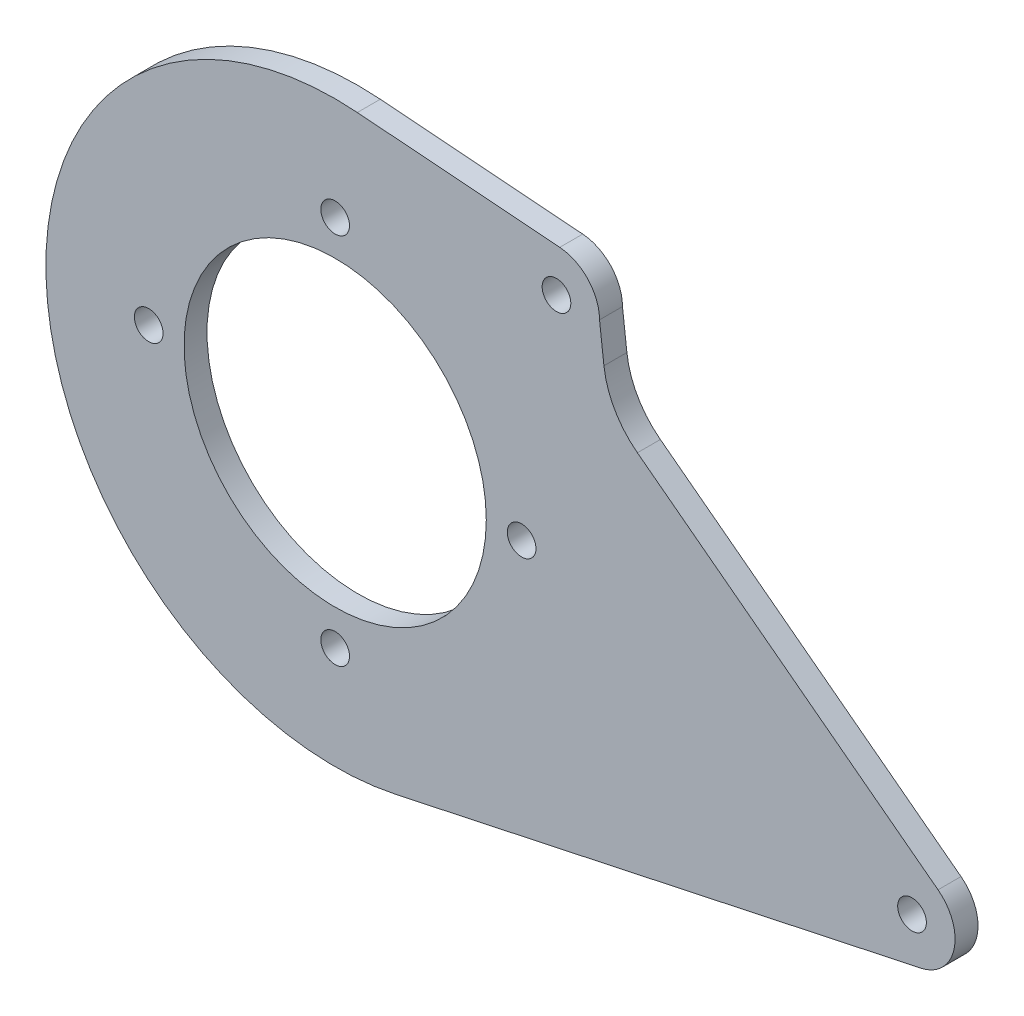
ISO-10303-21;
HEADER;
FILE_DESCRIPTION(('STEP AP214'),'2;1');
FILE_NAME('part.step','',(''),(''),'','','');
FILE_SCHEMA(('AUTOMOTIVE_DESIGN { 1 0 10303 214 1 1 1 1 }'));
ENDSEC;
DATA;
#1=APPLICATION_CONTEXT('core data for automotive mechanical design processes');
#2=APPLICATION_PROTOCOL_DEFINITION('international standard','automotive_design',2000,#1);
#3=PRODUCT_CONTEXT('',#1,'mechanical');
#4=PRODUCT('Part','Part','',(#3));
#5=PRODUCT_RELATED_PRODUCT_CATEGORY('part','',(#4));
#6=PRODUCT_DEFINITION_FORMATION('','',#4);
#7=PRODUCT_DEFINITION_CONTEXT('part definition',#1,'design');
#8=PRODUCT_DEFINITION('design','',#6,#7);
#9=PRODUCT_DEFINITION_SHAPE('','',#8);
#10=(LENGTH_UNIT() NAMED_UNIT(*) SI_UNIT(.MILLI.,.METRE.));
#11=(NAMED_UNIT(*) PLANE_ANGLE_UNIT() SI_UNIT($,.RADIAN.));
#12=(NAMED_UNIT(*) SI_UNIT($,.STERADIAN.) SOLID_ANGLE_UNIT());
#13=UNCERTAINTY_MEASURE_WITH_UNIT(LENGTH_MEASURE(1.E-05),#10,'distance_accuracy_value','');
#14=(GEOMETRIC_REPRESENTATION_CONTEXT(3) GLOBAL_UNCERTAINTY_ASSIGNED_CONTEXT((#13)) GLOBAL_UNIT_ASSIGNED_CONTEXT((#10,
#11,#12)) REPRESENTATION_CONTEXT('',''));
#15=CARTESIAN_POINT('',(0.,0.,0.));
#16=DIRECTION('',(0.,0.,1.));
#17=DIRECTION('',(1.,0.,0.));
#18=AXIS2_PLACEMENT_3D('',#15,#16,#17);
#19=CARTESIAN_POINT('',(0.,0.,10.16));
#20=DIRECTION('',(0.,0.,1.));
#21=DIRECTION('',(1.,0.,0.));
#22=AXIS2_PLACEMENT_3D('',#19,#20,#21);
#23=PLANE('',#22);
#24=CARTESIAN_POINT('',(82.5,0.,10.16));
#25=DIRECTION('',(0.,0.,1.));
#26=DIRECTION('',(1.,0.,0.));
#27=AXIS2_PLACEMENT_3D('',#24,#25,#26);
#28=CIRCLE('',#27,6.35);
#29=CARTESIAN_POINT('',(88.85,0.,10.16));
#30=VERTEX_POINT('',#29);
#31=EDGE_CURVE('E214',#30,#30,#28,.T.);
#32=ORIENTED_EDGE('',*,*,#31,.F.);
#33=EDGE_LOOP('',(#32));
#34=FACE_BOUND('',#33,.T.);
#35=CARTESIAN_POINT('',(-82.5,0.,10.16));
#36=DIRECTION('',(0.,0.,1.));
#37=DIRECTION('',(1.,0.,0.));
#38=AXIS2_PLACEMENT_3D('',#35,#36,#37);
#39=CIRCLE('',#38,6.35);
#40=CARTESIAN_POINT('',(-76.15,0.,10.16));
#41=VERTEX_POINT('',#40);
#42=EDGE_CURVE('E202',#41,#41,#39,.T.);
#43=ORIENTED_EDGE('',*,*,#42,.F.);
#44=EDGE_LOOP('',(#43));
#45=FACE_BOUND('',#44,.T.);
#46=CARTESIAN_POINT('',(0.,0.,10.16));
#47=DIRECTION('',(0.,0.,1.));
#48=DIRECTION('',(1.,0.,0.));
#49=AXIS2_PLACEMENT_3D('',#46,#47,#48);
#50=CIRCLE('',#49,66.87);
#51=CARTESIAN_POINT('',(66.87,0.,10.16));
#52=VERTEX_POINT('',#51);
#53=EDGE_CURVE('E190',#52,#52,#50,.T.);
#54=ORIENTED_EDGE('',*,*,#53,.F.);
#55=EDGE_LOOP('',(#54));
#56=FACE_BOUND('',#55,.T.);
#57=CARTESIAN_POINT('',(0.,0.,10.16));
#58=DIRECTION('',(0.,0.,1.));
#59=DIRECTION('',(1.,0.,0.));
#60=AXIS2_PLACEMENT_3D('',#57,#58,#59);
#61=CIRCLE('',#60,128.);
#62=CARTESIAN_POINT('',(9.80508100267259,127.62390209726,10.16));
#63=VERTEX_POINT('',#62);
#64=CARTESIAN_POINT('',(26.7127683770055,-125.181580137161,10.16));
#65=VERTEX_POINT('',#64);
#66=EDGE_CURVE('E153',#63,#65,#61,.T.);
#67=ORIENTED_EDGE('',*,*,#66,.T.);
#68=DIRECTION('',(0.977981094821572,0.208693502945346,0.));
#69=VECTOR('',#68,1.);
#70=CARTESIAN_POINT('',(26.7127683770055,-125.181580137161,10.16));
#71=LINE('',#70,#69);
#72=CARTESIAN_POINT('',(259.206689864171,-75.5691989310529,10.16));
#73=VERTEX_POINT('',#72);
#74=EDGE_CURVE('E101',#65,#73,#71,.T.);
#75=ORIENTED_EDGE('',*,*,#74,.T.);
#76=CARTESIAN_POINT('',(255.236487197195,-56.9375057502599,10.16));
#77=DIRECTION('',(0.,0.,1.));
#78=DIRECTION('',(1.,0.,0.));
#79=AXIS2_PLACEMENT_3D('',#76,#77,#78);
#80=CIRCLE('',#79,19.0500000000018);
#81=CARTESIAN_POINT('',(266.753249652273,-41.7629651458977,10.16));
#82=VERTEX_POINT('',#81);
#83=EDGE_CURVE('E168',#73,#82,#80,.T.);
#84=ORIENTED_EDGE('',*,*,#83,.T.);
#85=DIRECTION('',(-0.796563811252454,0.604554459584051,0.));
#86=VECTOR('',#85,1.);
#87=CARTESIAN_POINT('',(133.724592453404,59.1995275332562,10.16));
#88=LINE('',#87,#86);
#89=CARTESIAN_POINT('',(133.724592453404,59.1995275332562,10.16));
#90=VERTEX_POINT('',#89);
#91=EDGE_CURVE('E181',#82,#90,#88,.T.);
#92=ORIENTED_EDGE('',*,*,#91,.T.);
#93=CARTESIAN_POINT('',(156.758117363557,89.5486087419742,10.16));
#94=DIRECTION('',(0.,0.,-1.));
#95=DIRECTION('',(-1.,0.,0.));
#96=AXIS2_PLACEMENT_3D('',#93,#94,#95);
#97=CIRCLE('',#96,38.1);
#98=CARTESIAN_POINT('',(118.916102857405,85.1223306083476,10.16));
#99=VERTEX_POINT('',#98);
#100=EDGE_CURVE('E120',#90,#99,#97,.T.);
#101=ORIENTED_EDGE('',*,*,#100,.T.);
#102=DIRECTION('',(-0.116175279097817,0.993228727195576,0.));
#103=VECTOR('',#102,1.);
#104=CARTESIAN_POINT('',(118.916102857405,85.1223306083476,10.16));
#105=LINE('',#104,#103);
#106=CARTESIAN_POINT('',(116.9714473922,101.747964629106,10.16));
#107=VERTEX_POINT('',#106);
#108=EDGE_CURVE('E114',#99,#107,#105,.T.);
#109=ORIENTED_EDGE('',*,*,#108,.T.);
#110=CARTESIAN_POINT('',(97.9214473921997,101.747964629106,10.16));
#111=DIRECTION('',(0.,0.,1.));
#112=DIRECTION('',(1.,0.,0.));
#113=AXIS2_PLACEMENT_3D('',#110,#111,#112);
#114=CIRCLE('',#113,19.05);
#115=CARTESIAN_POINT('',(99.3807192133006,120.741990683425,10.16));
#116=VERTEX_POINT('',#115);
#117=EDGE_CURVE('E118',#107,#116,#114,.T.);
#118=ORIENTED_EDGE('',*,*,#117,.T.);
#119=DIRECTION('',(-0.997061735134844,0.0766021953333798,0.));
#120=VECTOR('',#119,1.);
#121=CARTESIAN_POINT('',(9.80508100267259,127.62390209726,10.16));
#122=LINE('',#121,#120);
#123=EDGE_CURVE('E58',#116,#63,#122,.T.);
#124=ORIENTED_EDGE('',*,*,#123,.T.);
#125=EDGE_LOOP('',(#67,#75,#84,#92,#101,#109,#118,#124));
#126=FACE_BOUND('',#125,.T.);
#127=CARTESIAN_POINT('',(255.236487197195,-56.9375057502599,10.16));
#128=DIRECTION('',(0.,0.,1.));
#129=DIRECTION('',(1.,0.,0.));
#130=AXIS2_PLACEMENT_3D('',#127,#128,#129);
#131=CIRCLE('',#130,6.34999999999994);
#132=CARTESIAN_POINT('',(261.586487197195,-56.9375057502599,10.16));
#133=VERTEX_POINT('',#132);
#134=EDGE_CURVE('E142',#133,#133,#131,.T.);
#135=ORIENTED_EDGE('',*,*,#134,.F.);
#136=EDGE_LOOP('',(#135));
#137=FACE_BOUND('',#136,.T.);
#138=CARTESIAN_POINT('',(0.,82.5,10.16));
#139=DIRECTION('',(0.,0.,1.));
#140=DIRECTION('',(1.,0.,0.));
#141=AXIS2_PLACEMENT_3D('',#138,#139,#140);
#142=CIRCLE('',#141,6.35);
#143=CARTESIAN_POINT('',(6.35,82.5,10.16));
#144=VERTEX_POINT('',#143);
#145=EDGE_CURVE('E196',#144,#144,#142,.T.);
#146=ORIENTED_EDGE('',*,*,#145,.F.);
#147=EDGE_LOOP('',(#146));
#148=FACE_BOUND('',#147,.T.);
#149=CARTESIAN_POINT('',(1.00110585106407E-12,-82.5,10.16));
#150=DIRECTION('',(0.,0.,1.));
#151=DIRECTION('',(1.,0.,0.));
#152=AXIS2_PLACEMENT_3D('',#149,#150,#151);
#153=CIRCLE('',#152,6.35);
#154=CARTESIAN_POINT('',(6.350000000001,-82.5,10.16));
#155=VERTEX_POINT('',#154);
#156=EDGE_CURVE('E208',#155,#155,#153,.T.);
#157=ORIENTED_EDGE('',*,*,#156,.F.);
#158=EDGE_LOOP('',(#157));
#159=FACE_BOUND('',#158,.T.);
#160=CARTESIAN_POINT('',(97.9214473921997,101.747964629106,10.16));
#161=DIRECTION('',(0.,0.,1.));
#162=DIRECTION('',(1.,0.,0.));
#163=AXIS2_PLACEMENT_3D('',#160,#161,#162);
#164=CIRCLE('',#163,6.34999999999999);
#165=CARTESIAN_POINT('',(104.2714473922,101.747964629106,10.16));
#166=VERTEX_POINT('',#165);
#167=EDGE_CURVE('E220',#166,#166,#164,.T.);
#168=ORIENTED_EDGE('',*,*,#167,.F.);
#169=EDGE_LOOP('',(#168));
#170=FACE_BOUND('',#169,.T.);
#171=ADVANCED_FACE('F41',(#34,#45,#56,#126,#137,#148,#159,#170),#23,.T.);
#172=CARTESIAN_POINT('',(0.,0.,0.));
#173=DIRECTION('',(0.,0.,1.));
#174=DIRECTION('',(1.,0.,0.));
#175=AXIS2_PLACEMENT_3D('',#172,#173,#174);
#176=PLANE('',#175);
#177=CARTESIAN_POINT('',(0.,0.,0.));
#178=DIRECTION('',(0.,0.,1.));
#179=DIRECTION('',(1.,0.,0.));
#180=AXIS2_PLACEMENT_3D('',#177,#178,#179);
#181=CIRCLE('',#180,128.);
#182=CARTESIAN_POINT('',(9.80508100267259,127.62390209726,0.));
#183=VERTEX_POINT('',#182);
#184=CARTESIAN_POINT('',(26.7127683770055,-125.181580137161,0.));
#185=VERTEX_POINT('',#184);
#186=EDGE_CURVE('E138',#183,#185,#181,.T.);
#187=ORIENTED_EDGE('',*,*,#186,.F.);
#188=DIRECTION('',(-0.997061735134844,0.0766021953333798,0.));
#189=VECTOR('',#188,1.);
#190=CARTESIAN_POINT('',(9.80508100267259,127.62390209726,0.));
#191=LINE('',#190,#189);
#192=CARTESIAN_POINT('',(99.3807192133006,120.741990683425,0.));
#193=VERTEX_POINT('',#192);
#194=EDGE_CURVE('E93',#193,#183,#191,.T.);
#195=ORIENTED_EDGE('',*,*,#194,.F.);
#196=CARTESIAN_POINT('',(97.9214473921997,101.747964629106,0.));
#197=DIRECTION('',(0.,0.,1.));
#198=DIRECTION('',(1.,0.,0.));
#199=AXIS2_PLACEMENT_3D('',#196,#197,#198);
#200=CIRCLE('',#199,19.05);
#201=CARTESIAN_POINT('',(116.9714473922,101.747964629106,0.));
#202=VERTEX_POINT('',#201);
#203=EDGE_CURVE('E87',#202,#193,#200,.T.);
#204=ORIENTED_EDGE('',*,*,#203,.F.);
#205=DIRECTION('',(-0.116175279097817,0.993228727195576,0.));
#206=VECTOR('',#205,1.);
#207=CARTESIAN_POINT('',(118.916102857405,85.1223306083476,0.));
#208=LINE('',#207,#206);
#209=CARTESIAN_POINT('',(118.916102857405,85.1223306083476,0.));
#210=VERTEX_POINT('',#209);
#211=EDGE_CURVE('E128',#210,#202,#208,.T.);
#212=ORIENTED_EDGE('',*,*,#211,.F.);
#213=CARTESIAN_POINT('',(156.758117363557,89.5486087419742,0.));
#214=DIRECTION('',(0.,0.,-1.));
#215=DIRECTION('',(-1.,0.,0.));
#216=AXIS2_PLACEMENT_3D('',#213,#214,#215);
#217=CIRCLE('',#216,38.1);
#218=CARTESIAN_POINT('',(133.724592453404,59.1995275332562,0.));
#219=VERTEX_POINT('',#218);
#220=EDGE_CURVE('E148',#219,#210,#217,.T.);
#221=ORIENTED_EDGE('',*,*,#220,.F.);
#222=DIRECTION('',(-0.796563811252454,0.604554459584051,0.));
#223=VECTOR('',#222,1.);
#224=CARTESIAN_POINT('',(133.724592453404,59.1995275332562,0.));
#225=LINE('',#224,#223);
#226=CARTESIAN_POINT('',(266.753249652273,-41.7629651458977,0.));
#227=VERTEX_POINT('',#226);
#228=EDGE_CURVE('E146',#227,#219,#225,.T.);
#229=ORIENTED_EDGE('',*,*,#228,.F.);
#230=CARTESIAN_POINT('',(255.236487197195,-56.9375057502599,0.));
#231=DIRECTION('',(0.,0.,1.));
#232=DIRECTION('',(1.,0.,0.));
#233=AXIS2_PLACEMENT_3D('',#230,#231,#232);
#234=CIRCLE('',#233,19.0500000000018);
#235=CARTESIAN_POINT('',(259.206689864171,-75.5691989310529,0.));
#236=VERTEX_POINT('',#235);
#237=EDGE_CURVE('E144',#236,#227,#234,.T.);
#238=ORIENTED_EDGE('',*,*,#237,.F.);
#239=DIRECTION('',(0.977981094821572,0.208693502945346,0.));
#240=VECTOR('',#239,1.);
#241=CARTESIAN_POINT('',(26.7127683770055,-125.181580137161,0.));
#242=LINE('',#241,#240);
#243=EDGE_CURVE('E141',#185,#236,#242,.T.);
#244=ORIENTED_EDGE('',*,*,#243,.F.);
#245=EDGE_LOOP('',(#187,#195,#204,#212,#221,#229,#238,#244));
#246=FACE_BOUND('',#245,.T.);
#247=CARTESIAN_POINT('',(255.236487197195,-56.9375057502599,0.));
#248=DIRECTION('',(0.,0.,1.));
#249=DIRECTION('',(1.,0.,0.));
#250=AXIS2_PLACEMENT_3D('',#247,#248,#249);
#251=CIRCLE('',#250,6.34999999999994);
#252=CARTESIAN_POINT('',(261.586487197195,-56.9375057502599,0.));
#253=VERTEX_POINT('',#252);
#254=EDGE_CURVE('E187',#253,#253,#251,.T.);
#255=ORIENTED_EDGE('',*,*,#254,.T.);
#256=EDGE_LOOP('',(#255));
#257=FACE_BOUND('',#256,.T.);
#258=CARTESIAN_POINT('',(0.,0.,0.));
#259=DIRECTION('',(0.,0.,1.));
#260=DIRECTION('',(1.,0.,0.));
#261=AXIS2_PLACEMENT_3D('',#258,#259,#260);
#262=CIRCLE('',#261,66.87);
#263=CARTESIAN_POINT('',(66.87,0.,0.));
#264=VERTEX_POINT('',#263);
#265=EDGE_CURVE('E193',#264,#264,#262,.T.);
#266=ORIENTED_EDGE('',*,*,#265,.T.);
#267=EDGE_LOOP('',(#266));
#268=FACE_BOUND('',#267,.T.);
#269=CARTESIAN_POINT('',(0.,82.5,0.));
#270=DIRECTION('',(0.,0.,1.));
#271=DIRECTION('',(1.,0.,0.));
#272=AXIS2_PLACEMENT_3D('',#269,#270,#271);
#273=CIRCLE('',#272,6.35);
#274=CARTESIAN_POINT('',(6.35,82.5,0.));
#275=VERTEX_POINT('',#274);
#276=EDGE_CURVE('E199',#275,#275,#273,.T.);
#277=ORIENTED_EDGE('',*,*,#276,.T.);
#278=EDGE_LOOP('',(#277));
#279=FACE_BOUND('',#278,.T.);
#280=CARTESIAN_POINT('',(-82.5,0.,0.));
#281=DIRECTION('',(0.,0.,1.));
#282=DIRECTION('',(1.,0.,0.));
#283=AXIS2_PLACEMENT_3D('',#280,#281,#282);
#284=CIRCLE('',#283,6.35);
#285=CARTESIAN_POINT('',(-76.15,0.,0.));
#286=VERTEX_POINT('',#285);
#287=EDGE_CURVE('E205',#286,#286,#284,.T.);
#288=ORIENTED_EDGE('',*,*,#287,.T.);
#289=EDGE_LOOP('',(#288));
#290=FACE_BOUND('',#289,.T.);
#291=CARTESIAN_POINT('',(1.00110585106407E-12,-82.5,0.));
#292=DIRECTION('',(0.,0.,1.));
#293=DIRECTION('',(1.,0.,0.));
#294=AXIS2_PLACEMENT_3D('',#291,#292,#293);
#295=CIRCLE('',#294,6.35);
#296=CARTESIAN_POINT('',(6.350000000001,-82.5,0.));
#297=VERTEX_POINT('',#296);
#298=EDGE_CURVE('E211',#297,#297,#295,.T.);
#299=ORIENTED_EDGE('',*,*,#298,.T.);
#300=EDGE_LOOP('',(#299));
#301=FACE_BOUND('',#300,.T.);
#302=CARTESIAN_POINT('',(82.5,0.,0.));
#303=DIRECTION('',(0.,0.,1.));
#304=DIRECTION('',(1.,0.,0.));
#305=AXIS2_PLACEMENT_3D('',#302,#303,#304);
#306=CIRCLE('',#305,6.35);
#307=CARTESIAN_POINT('',(88.85,0.,0.));
#308=VERTEX_POINT('',#307);
#309=EDGE_CURVE('E217',#308,#308,#306,.T.);
#310=ORIENTED_EDGE('',*,*,#309,.T.);
#311=EDGE_LOOP('',(#310));
#312=FACE_BOUND('',#311,.T.);
#313=CARTESIAN_POINT('',(97.9214473921997,101.747964629106,0.));
#314=DIRECTION('',(0.,0.,1.));
#315=DIRECTION('',(1.,0.,0.));
#316=AXIS2_PLACEMENT_3D('',#313,#314,#315);
#317=CIRCLE('',#316,6.34999999999999);
#318=CARTESIAN_POINT('',(104.2714473922,101.747964629106,0.));
#319=VERTEX_POINT('',#318);
#320=EDGE_CURVE('E223',#319,#319,#317,.T.);
#321=ORIENTED_EDGE('',*,*,#320,.T.);
#322=EDGE_LOOP('',(#321));
#323=FACE_BOUND('',#322,.T.);
#324=ADVANCED_FACE('F172',(#246,#257,#268,#279,#290,#301,#312,#323),#176,.F.);
#325=CARTESIAN_POINT('',(0.,0.,10.16));
#326=DIRECTION('',(0.,0.,-1.));
#327=DIRECTION('',(-1.,0.,0.));
#328=AXIS2_PLACEMENT_3D('',#325,#326,#327);
#329=CYLINDRICAL_SURFACE('',#328,128.);
#330=ORIENTED_EDGE('',*,*,#186,.T.);
#331=DIRECTION('',(0.,0.,-1.));
#332=VECTOR('',#331,1.);
#333=CARTESIAN_POINT('',(26.7127683770055,-125.181580137161,10.16));
#334=LINE('',#333,#332);
#335=EDGE_CURVE('E11',#65,#185,#334,.T.);
#336=ORIENTED_EDGE('',*,*,#335,.F.);
#337=ORIENTED_EDGE('',*,*,#66,.F.);
#338=DIRECTION('',(0.,0.,-1.));
#339=VECTOR('',#338,1.);
#340=CARTESIAN_POINT('',(9.80508100267259,127.62390209726,10.16));
#341=LINE('',#340,#339);
#342=EDGE_CURVE('E134',#63,#183,#341,.T.);
#343=ORIENTED_EDGE('',*,*,#342,.T.);
#344=EDGE_LOOP('',(#330,#336,#337,#343));
#345=FACE_BOUND('',#344,.T.);
#346=ADVANCED_FACE('F43',(#345),#329,.T.);
#347=CARTESIAN_POINT('',(26.7127683770055,-125.181580137161,10.16));
#348=DIRECTION('',(-0.208693502945346,0.977981094821572,0.));
#349=DIRECTION('',(-0.977981094821572,-0.208693502945346,0.));
#350=AXIS2_PLACEMENT_3D('',#347,#348,#349);
#351=PLANE('',#350);
#352=ORIENTED_EDGE('',*,*,#243,.T.);
#353=DIRECTION('',(0.,0.,-1.));
#354=VECTOR('',#353,1.);
#355=CARTESIAN_POINT('',(259.206689864171,-75.5691989310529,10.16));
#356=LINE('',#355,#354);
#357=EDGE_CURVE('E50',#73,#236,#356,.T.);
#358=ORIENTED_EDGE('',*,*,#357,.F.);
#359=ORIENTED_EDGE('',*,*,#74,.F.);
#360=ORIENTED_EDGE('',*,*,#335,.T.);
#361=EDGE_LOOP('',(#352,#358,#359,#360));
#362=FACE_BOUND('',#361,.T.);
#363=ADVANCED_FACE('F257',(#362),#351,.F.);
#364=CARTESIAN_POINT('',(255.236487197195,-56.9375057502599,10.16));
#365=DIRECTION('',(0.,0.,-1.));
#366=DIRECTION('',(-1.,0.,0.));
#367=AXIS2_PLACEMENT_3D('',#364,#365,#366);
#368=CYLINDRICAL_SURFACE('',#367,19.0500000000018);
#369=ORIENTED_EDGE('',*,*,#237,.T.);
#370=DIRECTION('',(0.,0.,-1.));
#371=VECTOR('',#370,1.);
#372=CARTESIAN_POINT('',(266.753249652273,-41.7629651458977,10.16));
#373=LINE('',#372,#371);
#374=EDGE_CURVE('E160',#82,#227,#373,.T.);
#375=ORIENTED_EDGE('',*,*,#374,.F.);
#376=ORIENTED_EDGE('',*,*,#83,.F.);
#377=ORIENTED_EDGE('',*,*,#357,.T.);
#378=EDGE_LOOP('',(#369,#375,#376,#377));
#379=FACE_BOUND('',#378,.T.);
#380=ADVANCED_FACE('F166',(#379),#368,.T.);
#381=CARTESIAN_POINT('',(133.724592453404,59.1995275332562,10.16));
#382=DIRECTION('',(-0.604554459584051,-0.796563811252454,0.));
#383=DIRECTION('',(0.796563811252454,-0.604554459584051,0.));
#384=AXIS2_PLACEMENT_3D('',#381,#382,#383);
#385=PLANE('',#384);
#386=ORIENTED_EDGE('',*,*,#228,.T.);
#387=DIRECTION('',(0.,0.,-1.));
#388=VECTOR('',#387,1.);
#389=CARTESIAN_POINT('',(133.724592453404,59.1995275332562,10.16));
#390=LINE('',#389,#388);
#391=EDGE_CURVE('E157',#90,#219,#390,.T.);
#392=ORIENTED_EDGE('',*,*,#391,.F.);
#393=ORIENTED_EDGE('',*,*,#91,.F.);
#394=ORIENTED_EDGE('',*,*,#374,.T.);
#395=EDGE_LOOP('',(#386,#392,#393,#394));
#396=FACE_BOUND('',#395,.T.);
#397=ADVANCED_FACE('F177',(#396),#385,.F.);
#398=CARTESIAN_POINT('',(156.758117363557,89.5486087419742,10.16));
#399=DIRECTION('',(0.,0.,-1.));
#400=DIRECTION('',(-1.,0.,0.));
#401=AXIS2_PLACEMENT_3D('',#398,#399,#400);
#402=CYLINDRICAL_SURFACE('',#401,38.1);
#403=ORIENTED_EDGE('',*,*,#220,.T.);
#404=DIRECTION('',(0.,0.,-1.));
#405=VECTOR('',#404,1.);
#406=CARTESIAN_POINT('',(118.916102857405,85.1223306083476,10.16));
#407=LINE('',#406,#405);
#408=EDGE_CURVE('E129',#99,#210,#407,.T.);
#409=ORIENTED_EDGE('',*,*,#408,.F.);
#410=ORIENTED_EDGE('',*,*,#100,.F.);
#411=ORIENTED_EDGE('',*,*,#391,.T.);
#412=EDGE_LOOP('',(#403,#409,#410,#411));
#413=FACE_BOUND('',#412,.T.);
#414=ADVANCED_FACE('F180',(#413),#402,.F.);
#415=CARTESIAN_POINT('',(118.916102857405,85.1223306083476,10.16));
#416=DIRECTION('',(-0.993228727195576,-0.116175279097817,0.));
#417=DIRECTION('',(0.116175279097817,-0.993228727195576,0.));
#418=AXIS2_PLACEMENT_3D('',#415,#416,#417);
#419=PLANE('',#418);
#420=ORIENTED_EDGE('',*,*,#211,.T.);
#421=DIRECTION('',(0.,0.,-1.));
#422=VECTOR('',#421,1.);
#423=CARTESIAN_POINT('',(116.9714473922,101.747964629106,10.16));
#424=LINE('',#423,#422);
#425=EDGE_CURVE('E125',#107,#202,#424,.T.);
#426=ORIENTED_EDGE('',*,*,#425,.F.);
#427=ORIENTED_EDGE('',*,*,#108,.F.);
#428=ORIENTED_EDGE('',*,*,#408,.T.);
#429=EDGE_LOOP('',(#420,#426,#427,#428));
#430=FACE_BOUND('',#429,.T.);
#431=ADVANCED_FACE('F126',(#430),#419,.F.);
#432=CARTESIAN_POINT('',(97.9214473921997,101.747964629106,10.16));
#433=DIRECTION('',(0.,0.,-1.));
#434=DIRECTION('',(-1.,0.,0.));
#435=AXIS2_PLACEMENT_3D('',#432,#433,#434);
#436=CYLINDRICAL_SURFACE('',#435,19.05);
#437=ORIENTED_EDGE('',*,*,#203,.T.);
#438=DIRECTION('',(0.,0.,-1.));
#439=VECTOR('',#438,1.);
#440=CARTESIAN_POINT('',(99.3807192133006,120.741990683425,10.16));
#441=LINE('',#440,#439);
#442=EDGE_CURVE('E130',#116,#193,#441,.T.);
#443=ORIENTED_EDGE('',*,*,#442,.F.);
#444=ORIENTED_EDGE('',*,*,#117,.F.);
#445=ORIENTED_EDGE('',*,*,#425,.T.);
#446=EDGE_LOOP('',(#437,#443,#444,#445));
#447=FACE_BOUND('',#446,.T.);
#448=ADVANCED_FACE('F132',(#447),#436,.T.);
#449=CARTESIAN_POINT('',(9.80508100267259,127.62390209726,10.16));
#450=DIRECTION('',(-0.0766021953333798,-0.997061735134845,0.));
#451=DIRECTION('',(0.997061735134845,-0.0766021953333798,0.));
#452=AXIS2_PLACEMENT_3D('',#449,#450,#451);
#453=PLANE('',#452);
#454=ORIENTED_EDGE('',*,*,#194,.T.);
#455=ORIENTED_EDGE('',*,*,#342,.F.);
#456=ORIENTED_EDGE('',*,*,#123,.F.);
#457=ORIENTED_EDGE('',*,*,#442,.T.);
#458=EDGE_LOOP('',(#454,#455,#456,#457));
#459=FACE_BOUND('',#458,.T.);
#460=ADVANCED_FACE('F245',(#459),#453,.F.);
#461=CARTESIAN_POINT('',(255.236487197195,-56.9375057502599,10.16));
#462=DIRECTION('',(0.,0.,-1.));
#463=DIRECTION('',(-1.,0.,0.));
#464=AXIS2_PLACEMENT_3D('',#461,#462,#463);
#465=CYLINDRICAL_SURFACE('',#464,6.34999999999994);
#466=ORIENTED_EDGE('',*,*,#134,.T.);
#467=EDGE_LOOP('',(#466));
#468=FACE_BOUND('',#467,.T.);
#469=ORIENTED_EDGE('',*,*,#254,.F.);
#470=EDGE_LOOP('',(#469));
#471=FACE_BOUND('',#470,.T.);
#472=ADVANCED_FACE('F242',(#468,#471),#465,.F.);
#473=CARTESIAN_POINT('',(0.,0.,10.16));
#474=DIRECTION('',(0.,0.,-1.));
#475=DIRECTION('',(-1.,0.,0.));
#476=AXIS2_PLACEMENT_3D('',#473,#474,#475);
#477=CYLINDRICAL_SURFACE('',#476,66.87);
#478=ORIENTED_EDGE('',*,*,#53,.T.);
#479=EDGE_LOOP('',(#478));
#480=FACE_BOUND('',#479,.T.);
#481=ORIENTED_EDGE('',*,*,#265,.F.);
#482=EDGE_LOOP('',(#481));
#483=FACE_BOUND('',#482,.T.);
#484=ADVANCED_FACE('F320',(#480,#483),#477,.F.);
#485=CARTESIAN_POINT('',(0.,82.5,10.16));
#486=DIRECTION('',(0.,0.,-1.));
#487=DIRECTION('',(-1.,0.,0.));
#488=AXIS2_PLACEMENT_3D('',#485,#486,#487);
#489=CYLINDRICAL_SURFACE('',#488,6.35);
#490=ORIENTED_EDGE('',*,*,#145,.T.);
#491=EDGE_LOOP('',(#490));
#492=FACE_BOUND('',#491,.T.);
#493=ORIENTED_EDGE('',*,*,#276,.F.);
#494=EDGE_LOOP('',(#493));
#495=FACE_BOUND('',#494,.T.);
#496=ADVANCED_FACE('F328',(#492,#495),#489,.F.);
#497=CARTESIAN_POINT('',(-82.5,0.,10.16));
#498=DIRECTION('',(0.,0.,-1.));
#499=DIRECTION('',(-1.,0.,0.));
#500=AXIS2_PLACEMENT_3D('',#497,#498,#499);
#501=CYLINDRICAL_SURFACE('',#500,6.35);
#502=ORIENTED_EDGE('',*,*,#42,.T.);
#503=EDGE_LOOP('',(#502));
#504=FACE_BOUND('',#503,.T.);
#505=ORIENTED_EDGE('',*,*,#287,.F.);
#506=EDGE_LOOP('',(#505));
#507=FACE_BOUND('',#506,.T.);
#508=ADVANCED_FACE('F336',(#504,#507),#501,.F.);
#509=CARTESIAN_POINT('',(1.00110585106407E-12,-82.5,10.16));
#510=DIRECTION('',(0.,0.,-1.));
#511=DIRECTION('',(-1.,0.,0.));
#512=AXIS2_PLACEMENT_3D('',#509,#510,#511);
#513=CYLINDRICAL_SURFACE('',#512,6.35);
#514=ORIENTED_EDGE('',*,*,#156,.T.);
#515=EDGE_LOOP('',(#514));
#516=FACE_BOUND('',#515,.T.);
#517=ORIENTED_EDGE('',*,*,#298,.F.);
#518=EDGE_LOOP('',(#517));
#519=FACE_BOUND('',#518,.T.);
#520=ADVANCED_FACE('F345',(#516,#519),#513,.F.);
#521=CARTESIAN_POINT('',(82.5,0.,10.16));
#522=DIRECTION('',(0.,0.,-1.));
#523=DIRECTION('',(-1.,0.,0.));
#524=AXIS2_PLACEMENT_3D('',#521,#522,#523);
#525=CYLINDRICAL_SURFACE('',#524,6.35);
#526=ORIENTED_EDGE('',*,*,#31,.T.);
#527=EDGE_LOOP('',(#526));
#528=FACE_BOUND('',#527,.T.);
#529=ORIENTED_EDGE('',*,*,#309,.F.);
#530=EDGE_LOOP('',(#529));
#531=FACE_BOUND('',#530,.T.);
#532=ADVANCED_FACE('F354',(#528,#531),#525,.F.);
#533=CARTESIAN_POINT('',(97.9214473921997,101.747964629106,10.16));
#534=DIRECTION('',(0.,0.,-1.));
#535=DIRECTION('',(-1.,0.,0.));
#536=AXIS2_PLACEMENT_3D('',#533,#534,#535);
#537=CYLINDRICAL_SURFACE('',#536,6.34999999999999);
#538=ORIENTED_EDGE('',*,*,#167,.T.);
#539=EDGE_LOOP('',(#538));
#540=FACE_BOUND('',#539,.T.);
#541=ORIENTED_EDGE('',*,*,#320,.F.);
#542=EDGE_LOOP('',(#541));
#543=FACE_BOUND('',#542,.T.);
#544=ADVANCED_FACE('F229',(#540,#543),#537,.F.);
#545=CLOSED_SHELL('',(#171,#324,#346,#363,#380,#397,#414,#431,#448,#460,#472,#484,#496,#508,
#520,#532,#544));
#546=MANIFOLD_SOLID_BREP('B2',#545);
#547=ADVANCED_BREP_SHAPE_REPRESENTATION('',(#18,#546),#14);
#548=SHAPE_DEFINITION_REPRESENTATION(#9,#547);
ENDSEC;
END-ISO-10303-21;
